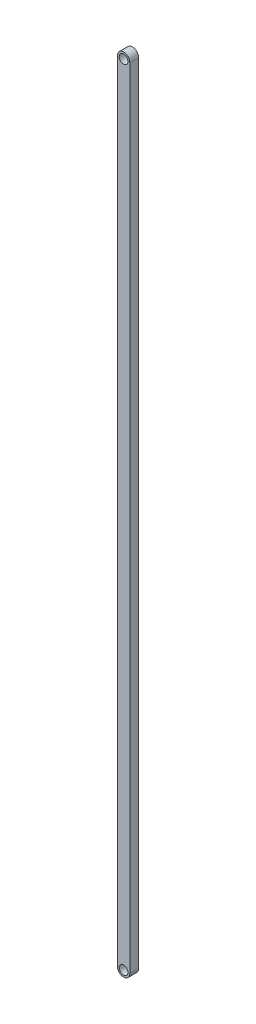
ISO-10303-21;
HEADER;
FILE_DESCRIPTION(('STEP AP214'),'2;1');
FILE_NAME('part.step','',(''),(''),'','','');
FILE_SCHEMA(('AUTOMOTIVE_DESIGN { 1 0 10303 214 1 1 1 1 }'));
ENDSEC;
DATA;
#1=APPLICATION_CONTEXT('core data for automotive mechanical design processes');
#2=APPLICATION_PROTOCOL_DEFINITION('international standard','automotive_design',2000,#1);
#3=PRODUCT_CONTEXT('',#1,'mechanical');
#4=PRODUCT('Part','Part','',(#3));
#5=PRODUCT_RELATED_PRODUCT_CATEGORY('part','',(#4));
#6=PRODUCT_DEFINITION_FORMATION('','',#4);
#7=PRODUCT_DEFINITION_CONTEXT('part definition',#1,'design');
#8=PRODUCT_DEFINITION('design','',#6,#7);
#9=PRODUCT_DEFINITION_SHAPE('','',#8);
#10=(LENGTH_UNIT() NAMED_UNIT(*) SI_UNIT(.MILLI.,.METRE.));
#11=(NAMED_UNIT(*) PLANE_ANGLE_UNIT() SI_UNIT($,.RADIAN.));
#12=(NAMED_UNIT(*) SI_UNIT($,.STERADIAN.) SOLID_ANGLE_UNIT());
#13=UNCERTAINTY_MEASURE_WITH_UNIT(LENGTH_MEASURE(1.E-05),#10,'distance_accuracy_value','');
#14=(GEOMETRIC_REPRESENTATION_CONTEXT(3) GLOBAL_UNCERTAINTY_ASSIGNED_CONTEXT((#13)) GLOBAL_UNIT_ASSIGNED_CONTEXT((#10,
#11,#12)) REPRESENTATION_CONTEXT('',''));
#15=CARTESIAN_POINT('',(0.,0.,0.));
#16=DIRECTION('',(0.,0.,1.));
#17=DIRECTION('',(1.,0.,0.));
#18=AXIS2_PLACEMENT_3D('',#15,#16,#17);
#19=CARTESIAN_POINT('',(0.,0.,2.5));
#20=DIRECTION('',(0.,0.,1.));
#21=DIRECTION('',(1.,0.,0.));
#22=AXIS2_PLACEMENT_3D('',#19,#20,#21);
#23=PLANE('',#22);
#24=CARTESIAN_POINT('',(0.,0.,2.5));
#25=DIRECTION('',(0.,0.,1.));
#26=DIRECTION('',(1.,0.,0.));
#27=AXIS2_PLACEMENT_3D('',#24,#25,#26);
#28=CIRCLE('',#27,2.5);
#29=CARTESIAN_POINT('',(2.5,0.,2.5));
#30=VERTEX_POINT('',#29);
#31=EDGE_CURVE('E118',#30,#30,#28,.T.);
#32=ORIENTED_EDGE('',*,*,#31,.F.);
#33=EDGE_LOOP('',(#32));
#34=FACE_BOUND('',#33,.T.);
#35=CARTESIAN_POINT('',(0.,0.,2.5));
#36=DIRECTION('',(0.,0.,1.));
#37=DIRECTION('',(1.,0.,0.));
#38=AXIS2_PLACEMENT_3D('',#35,#36,#37);
#39=CIRCLE('',#38,3.5);
#40=CARTESIAN_POINT('',(3.5,0.,2.5));
#41=VERTEX_POINT('',#40);
#42=CARTESIAN_POINT('',(-3.5,0.,2.5));
#43=VERTEX_POINT('',#42);
#44=EDGE_CURVE('E98',#41,#43,#39,.T.);
#45=ORIENTED_EDGE('',*,*,#44,.T.);
#46=DIRECTION('',(0.,-1.,0.));
#47=VECTOR('',#46,1.);
#48=CARTESIAN_POINT('',(-3.5,0.,2.5));
#49=LINE('',#48,#47);
#50=CARTESIAN_POINT('',(-3.5,-448.,2.5));
#51=VERTEX_POINT('',#50);
#52=EDGE_CURVE('E93',#43,#51,#49,.T.);
#53=ORIENTED_EDGE('',*,*,#52,.T.);
#54=CARTESIAN_POINT('',(0.,-448.,2.5));
#55=DIRECTION('',(0.,0.,1.));
#56=DIRECTION('',(1.,0.,0.));
#57=AXIS2_PLACEMENT_3D('',#54,#55,#56);
#58=CIRCLE('',#57,3.5);
#59=CARTESIAN_POINT('',(3.50000000000006,-448.,2.5));
#60=VERTEX_POINT('',#59);
#61=EDGE_CURVE('E96',#51,#60,#58,.T.);
#62=ORIENTED_EDGE('',*,*,#61,.T.);
#63=DIRECTION('',(0.,1.,0.));
#64=VECTOR('',#63,1.);
#65=CARTESIAN_POINT('',(3.5,0.,2.5));
#66=LINE('',#65,#64);
#67=EDGE_CURVE('E63',#60,#41,#66,.T.);
#68=ORIENTED_EDGE('',*,*,#67,.T.);
#69=EDGE_LOOP('',(#45,#53,#62,#68));
#70=FACE_BOUND('',#69,.T.);
#71=CARTESIAN_POINT('',(0.,-448.,2.5));
#72=DIRECTION('',(0.,0.,1.));
#73=DIRECTION('',(1.,0.,0.));
#74=AXIS2_PLACEMENT_3D('',#71,#72,#73);
#75=CIRCLE('',#74,2.5);
#76=CARTESIAN_POINT('',(2.5,-448.,2.5));
#77=VERTEX_POINT('',#76);
#78=EDGE_CURVE('E140',#77,#77,#75,.T.);
#79=ORIENTED_EDGE('',*,*,#78,.F.);
#80=EDGE_LOOP('',(#79));
#81=FACE_BOUND('',#80,.T.);
#82=ADVANCED_FACE('F45',(#34,#70,#81),#23,.T.);
#83=CARTESIAN_POINT('',(0.,0.,-2.5));
#84=DIRECTION('',(0.,0.,1.));
#85=DIRECTION('',(1.,0.,0.));
#86=AXIS2_PLACEMENT_3D('',#83,#84,#85);
#87=PLANE('',#86);
#88=CARTESIAN_POINT('',(0.,0.,-2.5));
#89=DIRECTION('',(0.,0.,1.));
#90=DIRECTION('',(1.,0.,0.));
#91=AXIS2_PLACEMENT_3D('',#88,#89,#90);
#92=CIRCLE('',#91,3.5);
#93=CARTESIAN_POINT('',(3.5,0.,-2.5));
#94=VERTEX_POINT('',#93);
#95=CARTESIAN_POINT('',(-3.5,0.,-2.5));
#96=VERTEX_POINT('',#95);
#97=EDGE_CURVE('E114',#94,#96,#92,.T.);
#98=ORIENTED_EDGE('',*,*,#97,.F.);
#99=DIRECTION('',(0.,1.,0.));
#100=VECTOR('',#99,1.);
#101=CARTESIAN_POINT('',(3.5,0.,-2.5));
#102=LINE('',#101,#100);
#103=CARTESIAN_POINT('',(3.50000000000006,-448.,-2.5));
#104=VERTEX_POINT('',#103);
#105=EDGE_CURVE('E86',#104,#94,#102,.T.);
#106=ORIENTED_EDGE('',*,*,#105,.F.);
#107=CARTESIAN_POINT('',(0.,-448.,-2.5));
#108=DIRECTION('',(0.,0.,1.));
#109=DIRECTION('',(1.,0.,0.));
#110=AXIS2_PLACEMENT_3D('',#107,#108,#109);
#111=CIRCLE('',#110,3.5);
#112=CARTESIAN_POINT('',(-3.5,-448.,-2.5));
#113=VERTEX_POINT('',#112);
#114=EDGE_CURVE('E80',#113,#104,#111,.T.);
#115=ORIENTED_EDGE('',*,*,#114,.F.);
#116=DIRECTION('',(0.,-1.,0.));
#117=VECTOR('',#116,1.);
#118=CARTESIAN_POINT('',(-3.5,0.,-2.5));
#119=LINE('',#118,#117);
#120=EDGE_CURVE('E103',#96,#113,#119,.T.);
#121=ORIENTED_EDGE('',*,*,#120,.F.);
#122=EDGE_LOOP('',(#98,#106,#115,#121));
#123=FACE_BOUND('',#122,.T.);
#124=CARTESIAN_POINT('',(0.,0.,-2.5));
#125=DIRECTION('',(0.,0.,1.));
#126=DIRECTION('',(1.,0.,0.));
#127=AXIS2_PLACEMENT_3D('',#124,#125,#126);
#128=CIRCLE('',#127,2.5);
#129=CARTESIAN_POINT('',(2.5,0.,-2.5));
#130=VERTEX_POINT('',#129);
#131=EDGE_CURVE('E136',#130,#130,#128,.T.);
#132=ORIENTED_EDGE('',*,*,#131,.T.);
#133=EDGE_LOOP('',(#132));
#134=FACE_BOUND('',#133,.T.);
#135=CARTESIAN_POINT('',(0.,-448.,-2.5));
#136=DIRECTION('',(0.,0.,1.));
#137=DIRECTION('',(1.,0.,0.));
#138=AXIS2_PLACEMENT_3D('',#135,#136,#137);
#139=CIRCLE('',#138,2.5);
#140=CARTESIAN_POINT('',(2.5,-448.,-2.5));
#141=VERTEX_POINT('',#140);
#142=EDGE_CURVE('E144',#141,#141,#139,.T.);
#143=ORIENTED_EDGE('',*,*,#142,.T.);
#144=EDGE_LOOP('',(#143));
#145=FACE_BOUND('',#144,.T.);
#146=ADVANCED_FACE('F131',(#123,#134,#145),#87,.F.);
#147=CARTESIAN_POINT('',(0.,0.,2.5));
#148=DIRECTION('',(0.,0.,-1.));
#149=DIRECTION('',(-1.,0.,0.));
#150=AXIS2_PLACEMENT_3D('',#147,#148,#149);
#151=CYLINDRICAL_SURFACE('',#150,3.5);
#152=ORIENTED_EDGE('',*,*,#97,.T.);
#153=DIRECTION('',(0.,0.,-1.));
#154=VECTOR('',#153,1.);
#155=CARTESIAN_POINT('',(-3.5,0.,2.5));
#156=LINE('',#155,#154);
#157=EDGE_CURVE('E11',#43,#96,#156,.T.);
#158=ORIENTED_EDGE('',*,*,#157,.F.);
#159=ORIENTED_EDGE('',*,*,#44,.F.);
#160=DIRECTION('',(0.,0.,-1.));
#161=VECTOR('',#160,1.);
#162=CARTESIAN_POINT('',(3.5,0.,2.5));
#163=LINE('',#162,#161);
#164=EDGE_CURVE('E110',#41,#94,#163,.T.);
#165=ORIENTED_EDGE('',*,*,#164,.T.);
#166=EDGE_LOOP('',(#152,#158,#159,#165));
#167=FACE_BOUND('',#166,.T.);
#168=ADVANCED_FACE('F47',(#167),#151,.T.);
#169=CARTESIAN_POINT('',(-3.5,0.,2.5));
#170=DIRECTION('',(1.,0.,0.));
#171=DIRECTION('',(0.,1.,0.));
#172=AXIS2_PLACEMENT_3D('',#169,#170,#171);
#173=PLANE('',#172);
#174=ORIENTED_EDGE('',*,*,#120,.T.);
#175=DIRECTION('',(0.,0.,-1.));
#176=VECTOR('',#175,1.);
#177=CARTESIAN_POINT('',(-3.5,-448.,2.5));
#178=LINE('',#177,#176);
#179=EDGE_CURVE('E55',#51,#113,#178,.T.);
#180=ORIENTED_EDGE('',*,*,#179,.F.);
#181=ORIENTED_EDGE('',*,*,#52,.F.);
#182=ORIENTED_EDGE('',*,*,#157,.T.);
#183=EDGE_LOOP('',(#174,#180,#181,#182));
#184=FACE_BOUND('',#183,.T.);
#185=ADVANCED_FACE('F102',(#184),#173,.F.);
#186=CARTESIAN_POINT('',(0.,-448.,2.5));
#187=DIRECTION('',(0.,0.,-1.));
#188=DIRECTION('',(-1.,0.,0.));
#189=AXIS2_PLACEMENT_3D('',#186,#187,#188);
#190=CYLINDRICAL_SURFACE('',#189,3.5);
#191=ORIENTED_EDGE('',*,*,#114,.T.);
#192=DIRECTION('',(0.,0.,-1.));
#193=VECTOR('',#192,1.);
#194=CARTESIAN_POINT('',(3.50000000000006,-448.,2.5));
#195=LINE('',#194,#193);
#196=EDGE_CURVE('E105',#60,#104,#195,.T.);
#197=ORIENTED_EDGE('',*,*,#196,.F.);
#198=ORIENTED_EDGE('',*,*,#61,.F.);
#199=ORIENTED_EDGE('',*,*,#179,.T.);
#200=EDGE_LOOP('',(#191,#197,#198,#199));
#201=FACE_BOUND('',#200,.T.);
#202=ADVANCED_FACE('F106',(#201),#190,.T.);
#203=CARTESIAN_POINT('',(3.5,0.,2.5));
#204=DIRECTION('',(-1.,0.,0.));
#205=DIRECTION('',(0.,-1.,0.));
#206=AXIS2_PLACEMENT_3D('',#203,#204,#205);
#207=PLANE('',#206);
#208=ORIENTED_EDGE('',*,*,#105,.T.);
#209=ORIENTED_EDGE('',*,*,#164,.F.);
#210=ORIENTED_EDGE('',*,*,#67,.F.);
#211=ORIENTED_EDGE('',*,*,#196,.T.);
#212=EDGE_LOOP('',(#208,#209,#210,#211));
#213=FACE_BOUND('',#212,.T.);
#214=ADVANCED_FACE('F128',(#213),#207,.F.);
#215=CARTESIAN_POINT('',(0.,0.,2.5));
#216=DIRECTION('',(0.,0.,-1.));
#217=DIRECTION('',(-1.,0.,0.));
#218=AXIS2_PLACEMENT_3D('',#215,#216,#217);
#219=CYLINDRICAL_SURFACE('',#218,2.5);
#220=ORIENTED_EDGE('',*,*,#31,.T.);
#221=EDGE_LOOP('',(#220));
#222=FACE_BOUND('',#221,.T.);
#223=ORIENTED_EDGE('',*,*,#131,.F.);
#224=EDGE_LOOP('',(#223));
#225=FACE_BOUND('',#224,.T.);
#226=ADVANCED_FACE('F163',(#222,#225),#219,.F.);
#227=CARTESIAN_POINT('',(0.,-448.,2.5));
#228=DIRECTION('',(0.,0.,-1.));
#229=DIRECTION('',(-1.,0.,0.));
#230=AXIS2_PLACEMENT_3D('',#227,#228,#229);
#231=CYLINDRICAL_SURFACE('',#230,2.5);
#232=ORIENTED_EDGE('',*,*,#78,.T.);
#233=EDGE_LOOP('',(#232));
#234=FACE_BOUND('',#233,.T.);
#235=ORIENTED_EDGE('',*,*,#142,.F.);
#236=EDGE_LOOP('',(#235));
#237=FACE_BOUND('',#236,.T.);
#238=ADVANCED_FACE('F152',(#234,#237),#231,.F.);
#239=CLOSED_SHELL('',(#82,#146,#168,#185,#202,#214,#226,#238));
#240=MANIFOLD_SOLID_BREP('B2',#239);
#241=ADVANCED_BREP_SHAPE_REPRESENTATION('',(#18,#240),#14);
#242=SHAPE_DEFINITION_REPRESENTATION(#9,#241);
ENDSEC;
END-ISO-10303-21;
